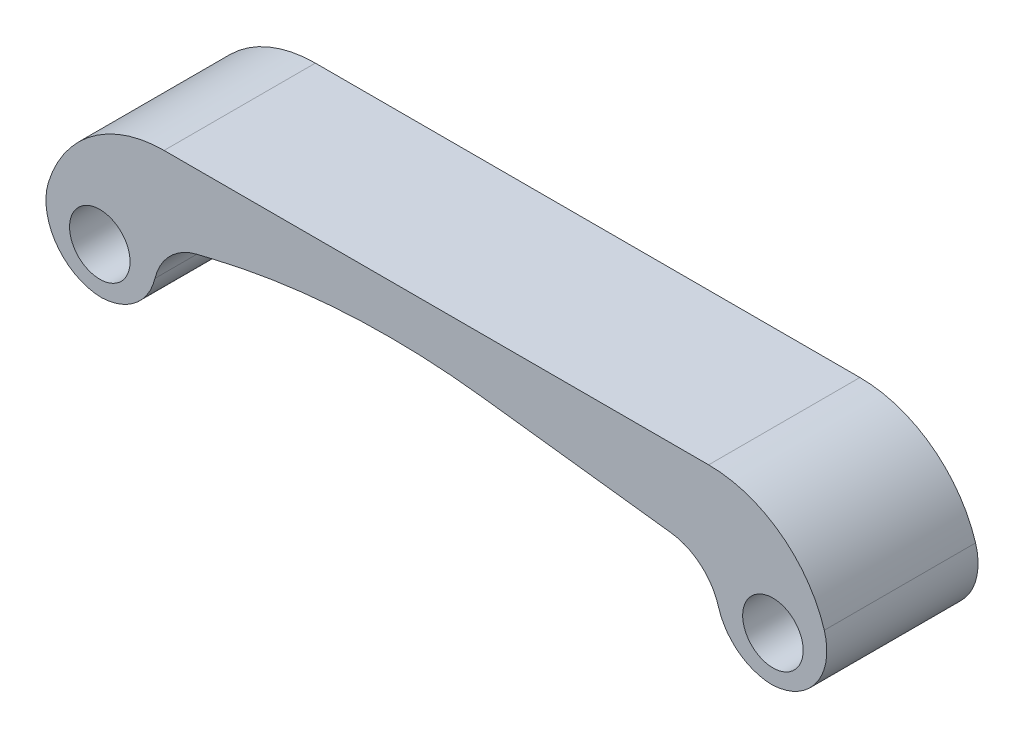
ISO-10303-21;
HEADER;
FILE_DESCRIPTION(('STEP AP214'),'2;1');
FILE_NAME('part.step','',(''),(''),'','','');
FILE_SCHEMA(('AUTOMOTIVE_DESIGN { 1 0 10303 214 1 1 1 1 }'));
ENDSEC;
DATA;
#1=APPLICATION_CONTEXT('core data for automotive mechanical design processes');
#2=APPLICATION_PROTOCOL_DEFINITION('international standard','automotive_design',2000,#1);
#3=PRODUCT_CONTEXT('',#1,'mechanical');
#4=PRODUCT('Part','Part','',(#3));
#5=PRODUCT_RELATED_PRODUCT_CATEGORY('part','',(#4));
#6=PRODUCT_DEFINITION_FORMATION('','',#4);
#7=PRODUCT_DEFINITION_CONTEXT('part definition',#1,'design');
#8=PRODUCT_DEFINITION('design','',#6,#7);
#9=PRODUCT_DEFINITION_SHAPE('','',#8);
#10=(LENGTH_UNIT() NAMED_UNIT(*) SI_UNIT(.MILLI.,.METRE.));
#11=(NAMED_UNIT(*) PLANE_ANGLE_UNIT() SI_UNIT($,.RADIAN.));
#12=(NAMED_UNIT(*) SI_UNIT($,.STERADIAN.) SOLID_ANGLE_UNIT());
#13=UNCERTAINTY_MEASURE_WITH_UNIT(LENGTH_MEASURE(1.E-05),#10,'distance_accuracy_value','');
#14=(GEOMETRIC_REPRESENTATION_CONTEXT(3) GLOBAL_UNCERTAINTY_ASSIGNED_CONTEXT((#13)) GLOBAL_UNIT_ASSIGNED_CONTEXT((#10,
#11,#12)) REPRESENTATION_CONTEXT('',''));
#15=CARTESIAN_POINT('',(0.,0.,0.));
#16=DIRECTION('',(0.,0.,1.));
#17=DIRECTION('',(1.,0.,0.));
#18=AXIS2_PLACEMENT_3D('',#15,#16,#17);
#19=CARTESIAN_POINT('',(0.,0.,5.));
#20=DIRECTION('',(0.,0.,-1.));
#21=DIRECTION('',(-1.,0.,0.));
#22=AXIS2_PLACEMENT_3D('',#19,#20,#21);
#23=PLANE('',#22);
#24=DIRECTION('',(0.992586388695407,-0.121541190452499,0.));
#25=VECTOR('',#24,1.);
#26=CARTESIAN_POINT('',(12.5,8.,5.));
#27=LINE('',#26,#25);
#28=CARTESIAN_POINT('',(21.4640627021442,6.9023596691252,5.));
#29=VERTEX_POINT('',#28);
#30=CARTESIAN_POINT('',(34.0074637029209,5.36643301596887,5.));
#31=VERTEX_POINT('',#30);
#32=EDGE_CURVE('E143',#29,#31,#27,.T.);
#33=ORIENTED_EDGE('',*,*,#32,.T.);
#34=CARTESIAN_POINT('',(33.5516842387241,1.64423405836109,5.));
#35=DIRECTION('',(0.,0.,-1.));
#36=DIRECTION('',(-1.,0.,0.));
#37=AXIS2_PLACEMENT_3D('',#34,#35,#36);
#38=CIRCLE('',#37,3.75);
#39=CARTESIAN_POINT('',(37.150842119362,2.69711702918055,5.));
#40=VERTEX_POINT('',#39);
#41=EDGE_CURVE('E11',#31,#40,#38,.T.);
#42=ORIENTED_EDGE('',*,*,#41,.T.);
#43=CARTESIAN_POINT('',(40.75,3.75,5.));
#44=DIRECTION('',(0.,0.,-1.));
#45=DIRECTION('',(-1.,0.,0.));
#46=AXIS2_PLACEMENT_3D('',#43,#44,#45);
#47=CIRCLE('',#46,3.75);
#48=CARTESIAN_POINT('',(40.656009601159,0.00117807772552405,5.));
#49=VERTEX_POINT('',#48);
#50=EDGE_CURVE('E210',#40,#49,#47,.F.);
#51=ORIENTED_EDGE('',*,*,#50,.T.);
#52=CARTESIAN_POINT('',(40.562019202318,3.75,5.));
#53=DIRECTION('',(0.,0.,-1.));
#54=DIRECTION('',(-1.,0.,0.));
#55=AXIS2_PLACEMENT_3D('',#52,#53,#54);
#56=CIRCLE('',#55,3.75);
#57=CARTESIAN_POINT('',(44.1461537925986,4.85294117647059,5.));
#58=VERTEX_POINT('',#57);
#59=EDGE_CURVE('E213',#49,#58,#56,.F.);
#60=ORIENTED_EDGE('',*,*,#59,.T.);
#61=CARTESIAN_POINT('',(36.5,2.5,5.));
#62=DIRECTION('',(0.,0.,-1.));
#63=DIRECTION('',(-1.,0.,0.));
#64=AXIS2_PLACEMENT_3D('',#61,#62,#63);
#65=CIRCLE('',#64,8.);
#66=CARTESIAN_POINT('',(36.5,10.5,5.));
#67=VERTEX_POINT('',#66);
#68=EDGE_CURVE('E180',#58,#67,#65,.F.);
#69=ORIENTED_EDGE('',*,*,#68,.T.);
#70=DIRECTION('',(-1.,0.,0.));
#71=VECTOR('',#70,1.);
#72=CARTESIAN_POINT('',(-7.5,10.5,5.));
#73=LINE('',#72,#71);
#74=CARTESIAN_POINT('',(0.5,10.5,5.));
#75=VERTEX_POINT('',#74);
#76=EDGE_CURVE('E145',#67,#75,#73,.T.);
#77=ORIENTED_EDGE('',*,*,#76,.T.);
#78=CARTESIAN_POINT('',(0.5,2.5,5.));
#79=DIRECTION('',(0.,0.,-1.));
#80=DIRECTION('',(-1.,0.,0.));
#81=AXIS2_PLACEMENT_3D('',#78,#79,#80);
#82=CIRCLE('',#81,8.);
#83=CARTESIAN_POINT('',(-7.14615379259855,4.85294117647059,5.));
#84=VERTEX_POINT('',#83);
#85=EDGE_CURVE('E183',#75,#84,#82,.F.);
#86=ORIENTED_EDGE('',*,*,#85,.T.);
#87=CARTESIAN_POINT('',(-3.56201920231798,3.75,5.));
#88=DIRECTION('',(0.,0.,-1.));
#89=DIRECTION('',(-1.,0.,0.));
#90=AXIS2_PLACEMENT_3D('',#87,#88,#89);
#91=CIRCLE('',#90,3.75);
#92=CARTESIAN_POINT('',(-3.65600960115899,0.00117807772552275,5.));
#93=VERTEX_POINT('',#92);
#94=EDGE_CURVE('E207',#84,#93,#91,.F.);
#95=ORIENTED_EDGE('',*,*,#94,.T.);
#96=CARTESIAN_POINT('',(-3.75,3.75,5.));
#97=DIRECTION('',(0.,0.,-1.));
#98=DIRECTION('',(-1.,0.,0.));
#99=AXIS2_PLACEMENT_3D('',#96,#97,#98);
#100=CIRCLE('',#99,3.75);
#101=CARTESIAN_POINT('',(-0.104299600718355,2.87172407600023,5.));
#102=VERTEX_POINT('',#101);
#103=EDGE_CURVE('E203',#93,#102,#100,.F.);
#104=ORIENTED_EDGE('',*,*,#103,.T.);
#105=CARTESIAN_POINT('',(3.54140079856329,1.99344815200046,5.));
#106=DIRECTION('',(0.,0.,-1.));
#107=DIRECTION('',(-1.,0.,0.));
#108=AXIS2_PLACEMENT_3D('',#105,#106,#107);
#109=CIRCLE('',#108,3.75);
#110=CARTESIAN_POINT('',(2.66625222678082,5.6399005344274,5.));
#111=VERTEX_POINT('',#110);
#112=EDGE_CURVE('E245',#102,#111,#109,.T.);
#113=ORIENTED_EDGE('',*,*,#112,.T.);
#114=DIRECTION('',(0.972387301980517,0.233372952475324,0.));
#115=VECTOR('',#114,1.);
#116=CARTESIAN_POINT('',(0.,5.,5.));
#117=LINE('',#116,#115);
#118=CARTESIAN_POINT('',(3.71835555575307,5.89240533338074,5.));
#119=VERTEX_POINT('',#118);
#120=EDGE_CURVE('E157',#111,#119,#117,.T.);
#121=ORIENTED_EDGE('',*,*,#120,.T.);
#122=CARTESIAN_POINT('',(15.3870031795193,-42.7269597656451,5.));
#123=DIRECTION('',(0.,0.,-1.));
#124=DIRECTION('',(-1.,0.,0.));
#125=AXIS2_PLACEMENT_3D('',#122,#123,#124);
#126=CIRCLE('',#125,50.);
#127=EDGE_CURVE('E139',#119,#29,#126,.T.);
#128=ORIENTED_EDGE('',*,*,#127,.T.);
#129=EDGE_LOOP('',(#33,#42,#51,#60,#69,#77,#86,#95,#104,#113,#121,#128));
#130=FACE_BOUND('',#129,.T.);
#131=CARTESIAN_POINT('',(-3.75,3.,5.));
#132=DIRECTION('',(0.,0.,1.));
#133=DIRECTION('',(1.,0.,0.));
#134=AXIS2_PLACEMENT_3D('',#131,#132,#133);
#135=CIRCLE('',#134,2.);
#136=CARTESIAN_POINT('',(-1.75,3.,5.));
#137=VERTEX_POINT('',#136);
#138=EDGE_CURVE('E159',#137,#137,#135,.T.);
#139=ORIENTED_EDGE('',*,*,#138,.F.);
#140=EDGE_LOOP('',(#139));
#141=FACE_BOUND('',#140,.T.);
#142=CARTESIAN_POINT('',(40.75,3.,5.));
#143=DIRECTION('',(0.,0.,1.));
#144=DIRECTION('',(1.,0.,0.));
#145=AXIS2_PLACEMENT_3D('',#142,#143,#144);
#146=CIRCLE('',#145,2.);
#147=CARTESIAN_POINT('',(42.75,3.,5.));
#148=VERTEX_POINT('',#147);
#149=EDGE_CURVE('E261',#148,#148,#146,.T.);
#150=ORIENTED_EDGE('',*,*,#149,.F.);
#151=EDGE_LOOP('',(#150));
#152=FACE_BOUND('',#151,.T.);
#153=ADVANCED_FACE('F39',(#130,#141,#152),#23,.F.);
#154=CARTESIAN_POINT('',(0.,0.,-5.));
#155=DIRECTION('',(0.,0.,-1.));
#156=DIRECTION('',(-1.,0.,0.));
#157=AXIS2_PLACEMENT_3D('',#154,#155,#156);
#158=PLANE('',#157);
#159=CARTESIAN_POINT('',(-3.75,3.,-5.));
#160=DIRECTION('',(0.,0.,1.));
#161=DIRECTION('',(1.,0.,0.));
#162=AXIS2_PLACEMENT_3D('',#159,#160,#161);
#163=CIRCLE('',#162,2.);
#164=CARTESIAN_POINT('',(-1.75,3.,-5.));
#165=VERTEX_POINT('',#164);
#166=EDGE_CURVE('E257',#165,#165,#163,.T.);
#167=ORIENTED_EDGE('',*,*,#166,.T.);
#168=EDGE_LOOP('',(#167));
#169=FACE_BOUND('',#168,.T.);
#170=CARTESIAN_POINT('',(36.5,2.5,-5.));
#171=DIRECTION('',(0.,0.,-1.));
#172=DIRECTION('',(-1.,0.,0.));
#173=AXIS2_PLACEMENT_3D('',#170,#171,#172);
#174=CIRCLE('',#173,8.);
#175=CARTESIAN_POINT('',(36.5,10.5,-5.));
#176=VERTEX_POINT('',#175);
#177=CARTESIAN_POINT('',(44.1461537925986,4.85294117647059,-5.));
#178=VERTEX_POINT('',#177);
#179=EDGE_CURVE('E167',#176,#178,#174,.T.);
#180=ORIENTED_EDGE('',*,*,#179,.T.);
#181=CARTESIAN_POINT('',(40.562019202318,3.75,-5.));
#182=DIRECTION('',(0.,0.,-1.));
#183=DIRECTION('',(-1.,0.,0.));
#184=AXIS2_PLACEMENT_3D('',#181,#182,#183);
#185=CIRCLE('',#184,3.75);
#186=CARTESIAN_POINT('',(40.656009601159,0.00117807772552405,-5.));
#187=VERTEX_POINT('',#186);
#188=EDGE_CURVE('E200',#178,#187,#185,.T.);
#189=ORIENTED_EDGE('',*,*,#188,.T.);
#190=CARTESIAN_POINT('',(40.75,3.75,-5.));
#191=DIRECTION('',(0.,0.,-1.));
#192=DIRECTION('',(-1.,0.,0.));
#193=AXIS2_PLACEMENT_3D('',#190,#191,#192);
#194=CIRCLE('',#193,3.75);
#195=CARTESIAN_POINT('',(37.150842119362,2.69711702918055,-5.));
#196=VERTEX_POINT('',#195);
#197=EDGE_CURVE('E197',#187,#196,#194,.T.);
#198=ORIENTED_EDGE('',*,*,#197,.T.);
#199=CARTESIAN_POINT('',(33.5516842387241,1.64423405836109,-5.));
#200=DIRECTION('',(0.,0.,-1.));
#201=DIRECTION('',(-1.,0.,0.));
#202=AXIS2_PLACEMENT_3D('',#199,#200,#201);
#203=CIRCLE('',#202,3.75);
#204=CARTESIAN_POINT('',(34.0074637029209,5.36643301596887,-5.));
#205=VERTEX_POINT('',#204);
#206=EDGE_CURVE('E48',#196,#205,#203,.F.);
#207=ORIENTED_EDGE('',*,*,#206,.T.);
#208=DIRECTION('',(0.992586388695407,-0.121541190452499,0.));
#209=VECTOR('',#208,1.);
#210=CARTESIAN_POINT('',(12.5,8.,-5.));
#211=LINE('',#210,#209);
#212=CARTESIAN_POINT('',(21.4640627021442,6.9023596691252,-5.));
#213=VERTEX_POINT('',#212);
#214=EDGE_CURVE('E142',#213,#205,#211,.T.);
#215=ORIENTED_EDGE('',*,*,#214,.F.);
#216=CARTESIAN_POINT('',(15.3870031795193,-42.7269597656451,-5.));
#217=DIRECTION('',(0.,0.,-1.));
#218=DIRECTION('',(-1.,0.,0.));
#219=AXIS2_PLACEMENT_3D('',#216,#217,#218);
#220=CIRCLE('',#219,50.);
#221=CARTESIAN_POINT('',(3.71835555575307,5.89240533338074,-5.));
#222=VERTEX_POINT('',#221);
#223=EDGE_CURVE('E130',#213,#222,#220,.F.);
#224=ORIENTED_EDGE('',*,*,#223,.T.);
#225=DIRECTION('',(0.972387301980517,0.233372952475324,0.));
#226=VECTOR('',#225,1.);
#227=CARTESIAN_POINT('',(0.,5.,-5.));
#228=LINE('',#227,#226);
#229=CARTESIAN_POINT('',(2.66625222678082,5.6399005344274,-5.));
#230=VERTEX_POINT('',#229);
#231=EDGE_CURVE('E152',#230,#222,#228,.T.);
#232=ORIENTED_EDGE('',*,*,#231,.F.);
#233=CARTESIAN_POINT('',(3.54140079856329,1.99344815200046,-5.));
#234=DIRECTION('',(0.,0.,-1.));
#235=DIRECTION('',(-1.,0.,0.));
#236=AXIS2_PLACEMENT_3D('',#233,#234,#235);
#237=CIRCLE('',#236,3.75);
#238=CARTESIAN_POINT('',(-0.104299600718355,2.87172407600023,-5.));
#239=VERTEX_POINT('',#238);
#240=EDGE_CURVE('E242',#230,#239,#237,.F.);
#241=ORIENTED_EDGE('',*,*,#240,.T.);
#242=CARTESIAN_POINT('',(-3.75,3.75,-5.));
#243=DIRECTION('',(0.,0.,-1.));
#244=DIRECTION('',(-1.,0.,0.));
#245=AXIS2_PLACEMENT_3D('',#242,#243,#244);
#246=CIRCLE('',#245,3.75);
#247=CARTESIAN_POINT('',(-3.65600960115899,0.00117807772552275,-5.));
#248=VERTEX_POINT('',#247);
#249=EDGE_CURVE('E191',#239,#248,#246,.T.);
#250=ORIENTED_EDGE('',*,*,#249,.T.);
#251=CARTESIAN_POINT('',(-3.56201920231798,3.75,-5.));
#252=DIRECTION('',(0.,0.,-1.));
#253=DIRECTION('',(-1.,0.,0.));
#254=AXIS2_PLACEMENT_3D('',#251,#252,#253);
#255=CIRCLE('',#254,3.75);
#256=CARTESIAN_POINT('',(-7.14615379259855,4.85294117647059,-5.));
#257=VERTEX_POINT('',#256);
#258=EDGE_CURVE('E194',#248,#257,#255,.T.);
#259=ORIENTED_EDGE('',*,*,#258,.T.);
#260=CARTESIAN_POINT('',(0.5,2.5,-5.));
#261=DIRECTION('',(0.,0.,-1.));
#262=DIRECTION('',(-1.,0.,0.));
#263=AXIS2_PLACEMENT_3D('',#260,#261,#262);
#264=CIRCLE('',#263,8.);
#265=CARTESIAN_POINT('',(0.5,10.5,-5.));
#266=VERTEX_POINT('',#265);
#267=EDGE_CURVE('E170',#257,#266,#264,.T.);
#268=ORIENTED_EDGE('',*,*,#267,.T.);
#269=DIRECTION('',(-1.,0.,0.));
#270=VECTOR('',#269,1.);
#271=CARTESIAN_POINT('',(-7.5,10.5,-5.));
#272=LINE('',#271,#270);
#273=EDGE_CURVE('E151',#176,#266,#272,.T.);
#274=ORIENTED_EDGE('',*,*,#273,.F.);
#275=EDGE_LOOP('',(#180,#189,#198,#207,#215,#224,#232,#241,#250,#259,#268,#274));
#276=FACE_BOUND('',#275,.T.);
#277=CARTESIAN_POINT('',(40.75,3.,-5.));
#278=DIRECTION('',(0.,0.,1.));
#279=DIRECTION('',(1.,0.,0.));
#280=AXIS2_PLACEMENT_3D('',#277,#278,#279);
#281=CIRCLE('',#280,2.);
#282=CARTESIAN_POINT('',(42.75,3.,-5.));
#283=VERTEX_POINT('',#282);
#284=EDGE_CURVE('E225',#283,#283,#281,.T.);
#285=ORIENTED_EDGE('',*,*,#284,.T.);
#286=EDGE_LOOP('',(#285));
#287=FACE_BOUND('',#286,.T.);
#288=ADVANCED_FACE('F148',(#169,#276,#287),#158,.T.);
#289=CARTESIAN_POINT('',(0.,5.,5.));
#290=DIRECTION('',(-0.233372952475324,0.972387301980518,0.));
#291=DIRECTION('',(-0.972387301980518,-0.233372952475324,0.));
#292=AXIS2_PLACEMENT_3D('',#289,#290,#291);
#293=PLANE('',#292);
#294=ORIENTED_EDGE('',*,*,#120,.F.);
#295=DIRECTION('',(0.,0.,-1.));
#296=VECTOR('',#295,1.);
#297=CARTESIAN_POINT('',(2.66625222678083,5.6399005344274,5.));
#298=LINE('',#297,#296);
#299=EDGE_CURVE('E220',#111,#230,#298,.T.);
#300=ORIENTED_EDGE('',*,*,#299,.T.);
#301=ORIENTED_EDGE('',*,*,#231,.T.);
#302=DIRECTION('',(0.,0.,-1.));
#303=VECTOR('',#302,1.);
#304=CARTESIAN_POINT('',(3.71835555575307,5.89240533338074,5.));
#305=LINE('',#304,#303);
#306=EDGE_CURVE('E136',#222,#119,#305,.F.);
#307=ORIENTED_EDGE('',*,*,#306,.T.);
#308=EDGE_LOOP('',(#294,#300,#301,#307));
#309=FACE_BOUND('',#308,.T.);
#310=ADVANCED_FACE('F280',(#309),#293,.F.);
#311=CARTESIAN_POINT('',(12.5,8.,5.));
#312=DIRECTION('',(0.121541190452499,0.992586388695407,0.));
#313=DIRECTION('',(-0.992586388695407,0.121541190452499,0.));
#314=AXIS2_PLACEMENT_3D('',#311,#312,#313);
#315=PLANE('',#314);
#316=ORIENTED_EDGE('',*,*,#214,.T.);
#317=DIRECTION('',(0.,0.,-1.));
#318=VECTOR('',#317,1.);
#319=CARTESIAN_POINT('',(34.0074637029209,5.36643301596887,5.));
#320=LINE('',#319,#318);
#321=EDGE_CURVE('E61',#205,#31,#320,.F.);
#322=ORIENTED_EDGE('',*,*,#321,.T.);
#323=ORIENTED_EDGE('',*,*,#32,.F.);
#324=DIRECTION('',(0.,0.,-1.));
#325=VECTOR('',#324,1.);
#326=CARTESIAN_POINT('',(21.4640627021442,6.9023596691252,-5.));
#327=LINE('',#326,#325);
#328=EDGE_CURVE('E134',#29,#213,#327,.T.);
#329=ORIENTED_EDGE('',*,*,#328,.T.);
#330=EDGE_LOOP('',(#316,#322,#323,#329));
#331=FACE_BOUND('',#330,.T.);
#332=ADVANCED_FACE('F141',(#331),#315,.F.);
#333=CARTESIAN_POINT('',(-7.5,10.5,5.));
#334=DIRECTION('',(0.,-1.,0.));
#335=DIRECTION('',(0.,0.,-1.));
#336=AXIS2_PLACEMENT_3D('',#333,#334,#335);
#337=PLANE('',#336);
#338=ORIENTED_EDGE('',*,*,#273,.T.);
#339=DIRECTION('',(0.,0.,-1.));
#340=VECTOR('',#339,1.);
#341=CARTESIAN_POINT('',(0.5,10.5,5.));
#342=LINE('',#341,#340);
#343=EDGE_CURVE('E177',#266,#75,#342,.F.);
#344=ORIENTED_EDGE('',*,*,#343,.T.);
#345=ORIENTED_EDGE('',*,*,#76,.F.);
#346=DIRECTION('',(0.,0.,-1.));
#347=VECTOR('',#346,1.);
#348=CARTESIAN_POINT('',(36.5,10.5,5.));
#349=LINE('',#348,#347);
#350=EDGE_CURVE('E173',#67,#176,#349,.T.);
#351=ORIENTED_EDGE('',*,*,#350,.T.);
#352=EDGE_LOOP('',(#338,#344,#345,#351));
#353=FACE_BOUND('',#352,.T.);
#354=ADVANCED_FACE('F288',(#353),#337,.F.);
#355=CARTESIAN_POINT('',(-3.75,3.,5.));
#356=DIRECTION('',(0.,0.,-1.));
#357=DIRECTION('',(-1.,0.,0.));
#358=AXIS2_PLACEMENT_3D('',#355,#356,#357);
#359=CYLINDRICAL_SURFACE('',#358,2.);
#360=ORIENTED_EDGE('',*,*,#138,.T.);
#361=EDGE_LOOP('',(#360));
#362=FACE_BOUND('',#361,.T.);
#363=ORIENTED_EDGE('',*,*,#166,.F.);
#364=EDGE_LOOP('',(#363));
#365=FACE_BOUND('',#364,.T.);
#366=ADVANCED_FACE('F285',(#362,#365),#359,.F.);
#367=CARTESIAN_POINT('',(40.75,3.,5.));
#368=DIRECTION('',(0.,0.,-1.));
#369=DIRECTION('',(-1.,0.,0.));
#370=AXIS2_PLACEMENT_3D('',#367,#368,#369);
#371=CYLINDRICAL_SURFACE('',#370,2.);
#372=ORIENTED_EDGE('',*,*,#149,.T.);
#373=EDGE_LOOP('',(#372));
#374=FACE_BOUND('',#373,.T.);
#375=ORIENTED_EDGE('',*,*,#284,.F.);
#376=EDGE_LOOP('',(#375));
#377=FACE_BOUND('',#376,.T.);
#378=ADVANCED_FACE('F272',(#374,#377),#371,.F.);
#379=CARTESIAN_POINT('',(15.3870031795193,-42.7269597656451,5.));
#380=DIRECTION('',(0.,0.,1.));
#381=DIRECTION('',(1.,0.,0.));
#382=AXIS2_PLACEMENT_3D('',#379,#380,#381);
#383=CYLINDRICAL_SURFACE('',#382,50.);
#384=ORIENTED_EDGE('',*,*,#127,.F.);
#385=ORIENTED_EDGE('',*,*,#306,.F.);
#386=ORIENTED_EDGE('',*,*,#223,.F.);
#387=ORIENTED_EDGE('',*,*,#328,.F.);
#388=EDGE_LOOP('',(#384,#385,#386,#387));
#389=FACE_BOUND('',#388,.T.);
#390=ADVANCED_FACE('F133',(#389),#383,.F.);
#391=CARTESIAN_POINT('',(0.5,2.5,5.));
#392=DIRECTION('',(0.,0.,-1.));
#393=DIRECTION('',(-1.,0.,0.));
#394=AXIS2_PLACEMENT_3D('',#391,#392,#393);
#395=CYLINDRICAL_SURFACE('',#394,8.);
#396=ORIENTED_EDGE('',*,*,#267,.F.);
#397=DIRECTION('',(0.,0.,-1.));
#398=VECTOR('',#397,1.);
#399=CARTESIAN_POINT('',(-7.14615379259855,4.85294117647059,5.));
#400=LINE('',#399,#398);
#401=EDGE_CURVE('E216',#257,#84,#400,.F.);
#402=ORIENTED_EDGE('',*,*,#401,.T.);
#403=ORIENTED_EDGE('',*,*,#85,.F.);
#404=ORIENTED_EDGE('',*,*,#343,.F.);
#405=EDGE_LOOP('',(#396,#402,#403,#404));
#406=FACE_BOUND('',#405,.T.);
#407=ADVANCED_FACE('F299',(#406),#395,.T.);
#408=CARTESIAN_POINT('',(36.5,2.5,5.));
#409=DIRECTION('',(0.,0.,-1.));
#410=DIRECTION('',(-1.,0.,0.));
#411=AXIS2_PLACEMENT_3D('',#408,#409,#410);
#412=CYLINDRICAL_SURFACE('',#411,8.);
#413=ORIENTED_EDGE('',*,*,#68,.F.);
#414=DIRECTION('',(0.,0.,-1.));
#415=VECTOR('',#414,1.);
#416=CARTESIAN_POINT('',(44.1461537925986,4.85294117647059,5.));
#417=LINE('',#416,#415);
#418=EDGE_CURVE('E187',#58,#178,#417,.T.);
#419=ORIENTED_EDGE('',*,*,#418,.T.);
#420=ORIENTED_EDGE('',*,*,#179,.F.);
#421=ORIENTED_EDGE('',*,*,#350,.F.);
#422=EDGE_LOOP('',(#413,#419,#420,#421));
#423=FACE_BOUND('',#422,.T.);
#424=ADVANCED_FACE('F302',(#423),#412,.T.);
#425=CARTESIAN_POINT('',(40.75,3.75,5.));
#426=DIRECTION('',(0.,0.,-1.));
#427=DIRECTION('',(-1.,0.,0.));
#428=AXIS2_PLACEMENT_3D('',#425,#426,#427);
#429=CYLINDRICAL_SURFACE('',#428,3.75);
#430=ORIENTED_EDGE('',*,*,#50,.F.);
#431=DIRECTION('',(0.,0.,-1.));
#432=VECTOR('',#431,1.);
#433=CARTESIAN_POINT('',(37.150842119362,2.69711702918055,5.));
#434=LINE('',#433,#432);
#435=EDGE_CURVE('E236',#40,#196,#434,.T.);
#436=ORIENTED_EDGE('',*,*,#435,.T.);
#437=ORIENTED_EDGE('',*,*,#197,.F.);
#438=DIRECTION('',(0.,0.,-1.));
#439=VECTOR('',#438,1.);
#440=CARTESIAN_POINT('',(40.656009601159,0.00117807772552318,0.));
#441=LINE('',#440,#439);
#442=EDGE_CURVE('E221',#49,#187,#441,.T.);
#443=ORIENTED_EDGE('',*,*,#442,.F.);
#444=EDGE_LOOP('',(#430,#436,#437,#443));
#445=FACE_BOUND('',#444,.T.);
#446=ADVANCED_FACE('F306',(#445),#429,.T.);
#447=CARTESIAN_POINT('',(40.562019202318,3.75,5.));
#448=DIRECTION('',(0.,0.,-1.));
#449=DIRECTION('',(-1.,0.,0.));
#450=AXIS2_PLACEMENT_3D('',#447,#448,#449);
#451=CYLINDRICAL_SURFACE('',#450,3.75);
#452=ORIENTED_EDGE('',*,*,#59,.F.);
#453=ORIENTED_EDGE('',*,*,#442,.T.);
#454=ORIENTED_EDGE('',*,*,#188,.F.);
#455=ORIENTED_EDGE('',*,*,#418,.F.);
#456=EDGE_LOOP('',(#452,#453,#454,#455));
#457=FACE_BOUND('',#456,.T.);
#458=ADVANCED_FACE('F308',(#457),#451,.T.);
#459=CARTESIAN_POINT('',(-3.75,3.75,5.));
#460=DIRECTION('',(0.,0.,-1.));
#461=DIRECTION('',(-1.,0.,0.));
#462=AXIS2_PLACEMENT_3D('',#459,#460,#461);
#463=CYLINDRICAL_SURFACE('',#462,3.75);
#464=ORIENTED_EDGE('',*,*,#249,.F.);
#465=DIRECTION('',(0.,0.,-1.));
#466=VECTOR('',#465,1.);
#467=CARTESIAN_POINT('',(-0.104299600718355,2.87172407600023,5.));
#468=LINE('',#467,#466);
#469=EDGE_CURVE('E233',#239,#102,#468,.F.);
#470=ORIENTED_EDGE('',*,*,#469,.T.);
#471=ORIENTED_EDGE('',*,*,#103,.F.);
#472=DIRECTION('',(0.,0.,-1.));
#473=VECTOR('',#472,1.);
#474=CARTESIAN_POINT('',(-3.65600960115899,0.00117807772552188,0.));
#475=LINE('',#474,#473);
#476=EDGE_CURVE('E226',#248,#93,#475,.F.);
#477=ORIENTED_EDGE('',*,*,#476,.F.);
#478=EDGE_LOOP('',(#464,#470,#471,#477));
#479=FACE_BOUND('',#478,.T.);
#480=ADVANCED_FACE('F311',(#479),#463,.T.);
#481=CARTESIAN_POINT('',(-3.56201920231798,3.75,5.));
#482=DIRECTION('',(0.,0.,-1.));
#483=DIRECTION('',(-1.,0.,0.));
#484=AXIS2_PLACEMENT_3D('',#481,#482,#483);
#485=CYLINDRICAL_SURFACE('',#484,3.75);
#486=ORIENTED_EDGE('',*,*,#94,.F.);
#487=ORIENTED_EDGE('',*,*,#401,.F.);
#488=ORIENTED_EDGE('',*,*,#258,.F.);
#489=ORIENTED_EDGE('',*,*,#476,.T.);
#490=EDGE_LOOP('',(#486,#487,#488,#489));
#491=FACE_BOUND('',#490,.T.);
#492=ADVANCED_FACE('F316',(#491),#485,.T.);
#493=CARTESIAN_POINT('',(3.54140079856329,1.99344815200046,5.));
#494=DIRECTION('',(0.,0.,-1.));
#495=DIRECTION('',(-1.,0.,0.));
#496=AXIS2_PLACEMENT_3D('',#493,#494,#495);
#497=CYLINDRICAL_SURFACE('',#496,3.75);
#498=ORIENTED_EDGE('',*,*,#112,.F.);
#499=ORIENTED_EDGE('',*,*,#469,.F.);
#500=ORIENTED_EDGE('',*,*,#240,.F.);
#501=ORIENTED_EDGE('',*,*,#299,.F.);
#502=EDGE_LOOP('',(#498,#499,#500,#501));
#503=FACE_BOUND('',#502,.T.);
#504=ADVANCED_FACE('F319',(#503),#497,.F.);
#505=CARTESIAN_POINT('',(33.5516842387241,1.64423405836109,5.));
#506=DIRECTION('',(0.,0.,-1.));
#507=DIRECTION('',(-1.,0.,0.));
#508=AXIS2_PLACEMENT_3D('',#505,#506,#507);
#509=CYLINDRICAL_SURFACE('',#508,3.75);
#510=ORIENTED_EDGE('',*,*,#41,.F.);
#511=ORIENTED_EDGE('',*,*,#321,.F.);
#512=ORIENTED_EDGE('',*,*,#206,.F.);
#513=ORIENTED_EDGE('',*,*,#435,.F.);
#514=EDGE_LOOP('',(#510,#511,#512,#513));
#515=FACE_BOUND('',#514,.T.);
#516=ADVANCED_FACE('F41',(#515),#509,.F.);
#517=CLOSED_SHELL('',(#153,#288,#310,#332,#354,#366,#378,#390,#407,#424,#446,#458,#480,#492,
#504,#516));
#518=MANIFOLD_SOLID_BREP('B2',#517);
#519=ADVANCED_BREP_SHAPE_REPRESENTATION('',(#18,#518),#14);
#520=SHAPE_DEFINITION_REPRESENTATION(#9,#519);
ENDSEC;
END-ISO-10303-21;
